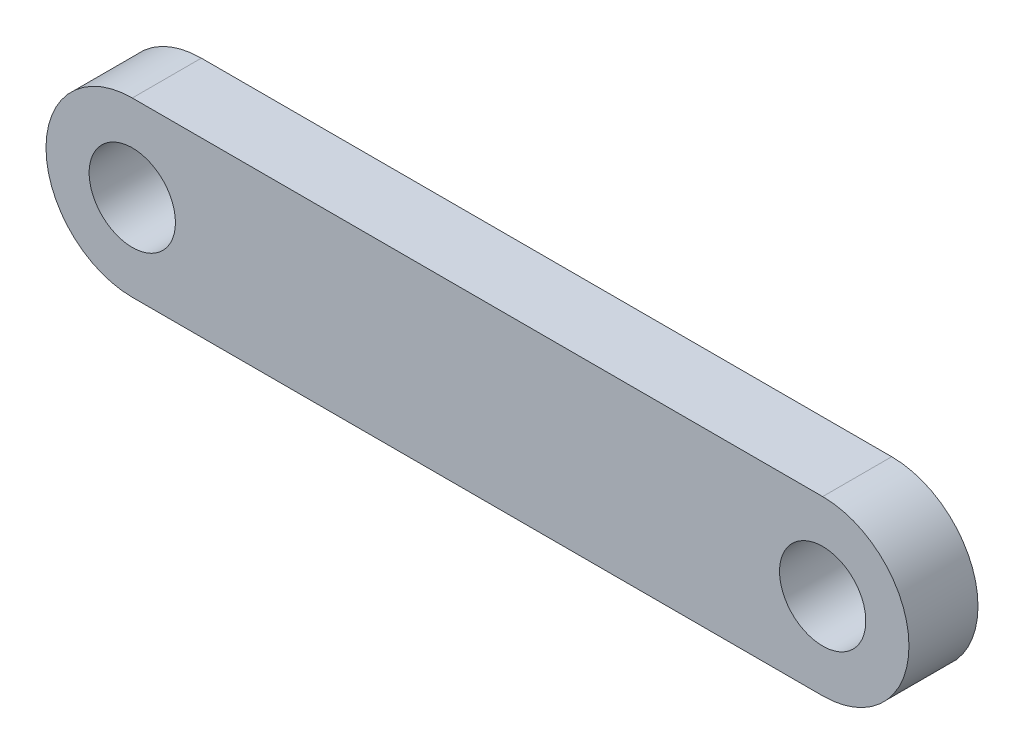
ISO-10303-21;
HEADER;
FILE_DESCRIPTION(('STEP AP214'),'2;1');
FILE_NAME('part.step','',(''),(''),'','','');
FILE_SCHEMA(('AUTOMOTIVE_DESIGN { 1 0 10303 214 1 1 1 1 }'));
ENDSEC;
DATA;
#1=APPLICATION_CONTEXT('core data for automotive mechanical design processes');
#2=APPLICATION_PROTOCOL_DEFINITION('international standard','automotive_design',2000,#1);
#3=PRODUCT_CONTEXT('',#1,'mechanical');
#4=PRODUCT('Part','Part','',(#3));
#5=PRODUCT_RELATED_PRODUCT_CATEGORY('part','',(#4));
#6=PRODUCT_DEFINITION_FORMATION('','',#4);
#7=PRODUCT_DEFINITION_CONTEXT('part definition',#1,'design');
#8=PRODUCT_DEFINITION('design','',#6,#7);
#9=PRODUCT_DEFINITION_SHAPE('','',#8);
#10=(LENGTH_UNIT() NAMED_UNIT(*) SI_UNIT(.MILLI.,.METRE.));
#11=(NAMED_UNIT(*) PLANE_ANGLE_UNIT() SI_UNIT($,.RADIAN.));
#12=(NAMED_UNIT(*) SI_UNIT($,.STERADIAN.) SOLID_ANGLE_UNIT());
#13=UNCERTAINTY_MEASURE_WITH_UNIT(LENGTH_MEASURE(1.E-05),#10,'distance_accuracy_value','');
#14=(GEOMETRIC_REPRESENTATION_CONTEXT(3) GLOBAL_UNCERTAINTY_ASSIGNED_CONTEXT((#13)) GLOBAL_UNIT_ASSIGNED_CONTEXT((#10,
#11,#12)) REPRESENTATION_CONTEXT('',''));
#15=CARTESIAN_POINT('',(0.,0.,0.));
#16=DIRECTION('',(0.,0.,1.));
#17=DIRECTION('',(1.,0.,0.));
#18=AXIS2_PLACEMENT_3D('',#15,#16,#17);
#19=CARTESIAN_POINT('',(-25.4,0.,5.08));
#20=DIRECTION('',(0.,0.,1.));
#21=DIRECTION('',(1.,0.,0.));
#22=AXIS2_PLACEMENT_3D('',#19,#20,#21);
#23=PLANE('',#22);
#24=CARTESIAN_POINT('',(-25.4,0.,5.08));
#25=DIRECTION('',(0.,0.,1.));
#26=DIRECTION('',(1.,0.,0.));
#27=AXIS2_PLACEMENT_3D('',#24,#25,#26);
#28=CIRCLE('',#27,3.175);
#29=CARTESIAN_POINT('',(-22.225,0.,5.08));
#30=VERTEX_POINT('',#29);
#31=EDGE_CURVE('E100',#30,#30,#28,.T.);
#32=ORIENTED_EDGE('',*,*,#31,.F.);
#33=EDGE_LOOP('',(#32));
#34=FACE_BOUND('',#33,.T.);
#35=CARTESIAN_POINT('',(-25.4,0.,5.08));
#36=DIRECTION('',(0.,0.,1.));
#37=DIRECTION('',(1.,0.,0.));
#38=AXIS2_PLACEMENT_3D('',#35,#36,#37);
#39=CIRCLE('',#38,6.35);
#40=CARTESIAN_POINT('',(-25.4,6.35,5.08));
#41=VERTEX_POINT('',#40);
#42=CARTESIAN_POINT('',(-25.4,-6.35,5.08));
#43=VERTEX_POINT('',#42);
#44=EDGE_CURVE('E85',#41,#43,#39,.T.);
#45=ORIENTED_EDGE('',*,*,#44,.T.);
#46=DIRECTION('',(1.,0.,0.));
#47=VECTOR('',#46,1.);
#48=CARTESIAN_POINT('',(-25.4,-6.35,5.08));
#49=LINE('',#48,#47);
#50=CARTESIAN_POINT('',(25.4,-6.35,5.08));
#51=VERTEX_POINT('',#50);
#52=EDGE_CURVE('E80',#43,#51,#49,.T.);
#53=ORIENTED_EDGE('',*,*,#52,.T.);
#54=CARTESIAN_POINT('',(25.4,0.,5.08));
#55=DIRECTION('',(0.,0.,1.));
#56=DIRECTION('',(1.,0.,0.));
#57=AXIS2_PLACEMENT_3D('',#54,#55,#56);
#58=CIRCLE('',#57,6.35);
#59=CARTESIAN_POINT('',(25.4,6.35,5.08));
#60=VERTEX_POINT('',#59);
#61=EDGE_CURVE('E83',#51,#60,#58,.T.);
#62=ORIENTED_EDGE('',*,*,#61,.T.);
#63=DIRECTION('',(-1.,0.,0.));
#64=VECTOR('',#63,1.);
#65=CARTESIAN_POINT('',(-25.4,6.35,5.08));
#66=LINE('',#65,#64);
#67=EDGE_CURVE('E50',#60,#41,#66,.T.);
#68=ORIENTED_EDGE('',*,*,#67,.T.);
#69=EDGE_LOOP('',(#45,#53,#62,#68));
#70=FACE_BOUND('',#69,.T.);
#71=CARTESIAN_POINT('',(25.4,0.,5.08));
#72=DIRECTION('',(0.,0.,1.));
#73=DIRECTION('',(-1.,0.,0.));
#74=AXIS2_PLACEMENT_3D('',#71,#72,#73);
#75=CIRCLE('',#74,3.175);
#76=CARTESIAN_POINT('',(22.225,0.,5.08));
#77=VERTEX_POINT('',#76);
#78=EDGE_CURVE('E115',#77,#77,#75,.T.);
#79=ORIENTED_EDGE('',*,*,#78,.F.);
#80=EDGE_LOOP('',(#79));
#81=FACE_BOUND('',#80,.T.);
#82=ADVANCED_FACE('F33',(#34,#70,#81),#23,.T.);
#83=CARTESIAN_POINT('',(-25.4,0.,0.));
#84=DIRECTION('',(0.,0.,1.));
#85=DIRECTION('',(1.,0.,0.));
#86=AXIS2_PLACEMENT_3D('',#83,#84,#85);
#87=PLANE('',#86);
#88=CARTESIAN_POINT('',(-25.4,0.,0.));
#89=DIRECTION('',(0.,0.,1.));
#90=DIRECTION('',(1.,0.,0.));
#91=AXIS2_PLACEMENT_3D('',#88,#89,#90);
#92=CIRCLE('',#91,6.35);
#93=CARTESIAN_POINT('',(-25.4,6.35,0.));
#94=VERTEX_POINT('',#93);
#95=CARTESIAN_POINT('',(-25.4,-6.35,0.));
#96=VERTEX_POINT('',#95);
#97=EDGE_CURVE('E97',#94,#96,#92,.T.);
#98=ORIENTED_EDGE('',*,*,#97,.F.);
#99=DIRECTION('',(-1.,0.,0.));
#100=VECTOR('',#99,1.);
#101=CARTESIAN_POINT('',(-25.4,6.35,0.));
#102=LINE('',#101,#100);
#103=CARTESIAN_POINT('',(25.4,6.35,0.));
#104=VERTEX_POINT('',#103);
#105=EDGE_CURVE('E73',#104,#94,#102,.T.);
#106=ORIENTED_EDGE('',*,*,#105,.F.);
#107=CARTESIAN_POINT('',(25.4,0.,0.));
#108=DIRECTION('',(0.,0.,1.));
#109=DIRECTION('',(1.,0.,0.));
#110=AXIS2_PLACEMENT_3D('',#107,#108,#109);
#111=CIRCLE('',#110,6.35);
#112=CARTESIAN_POINT('',(25.4,-6.35,0.));
#113=VERTEX_POINT('',#112);
#114=EDGE_CURVE('E67',#113,#104,#111,.T.);
#115=ORIENTED_EDGE('',*,*,#114,.F.);
#116=DIRECTION('',(1.,0.,0.));
#117=VECTOR('',#116,1.);
#118=CARTESIAN_POINT('',(-25.4,-6.35,0.));
#119=LINE('',#118,#117);
#120=EDGE_CURVE('E89',#96,#113,#119,.T.);
#121=ORIENTED_EDGE('',*,*,#120,.F.);
#122=EDGE_LOOP('',(#98,#106,#115,#121));
#123=FACE_BOUND('',#122,.T.);
#124=CARTESIAN_POINT('',(-25.4,0.,0.));
#125=DIRECTION('',(0.,0.,1.));
#126=DIRECTION('',(1.,0.,0.));
#127=AXIS2_PLACEMENT_3D('',#124,#125,#126);
#128=CIRCLE('',#127,3.175);
#129=CARTESIAN_POINT('',(-22.225,0.,0.));
#130=VERTEX_POINT('',#129);
#131=EDGE_CURVE('E112',#130,#130,#128,.T.);
#132=ORIENTED_EDGE('',*,*,#131,.T.);
#133=EDGE_LOOP('',(#132));
#134=FACE_BOUND('',#133,.T.);
#135=CARTESIAN_POINT('',(25.4,0.,0.));
#136=DIRECTION('',(0.,0.,1.));
#137=DIRECTION('',(-1.,0.,0.));
#138=AXIS2_PLACEMENT_3D('',#135,#136,#137);
#139=CIRCLE('',#138,3.175);
#140=CARTESIAN_POINT('',(22.225,0.,0.));
#141=VERTEX_POINT('',#140);
#142=EDGE_CURVE('E118',#141,#141,#139,.T.);
#143=ORIENTED_EDGE('',*,*,#142,.T.);
#144=EDGE_LOOP('',(#143));
#145=FACE_BOUND('',#144,.T.);
#146=ADVANCED_FACE('F108',(#123,#134,#145),#87,.F.);
#147=CARTESIAN_POINT('',(-25.4,0.,5.08));
#148=DIRECTION('',(0.,0.,-1.));
#149=DIRECTION('',(-1.,0.,0.));
#150=AXIS2_PLACEMENT_3D('',#147,#148,#149);
#151=CYLINDRICAL_SURFACE('',#150,6.35);
#152=ORIENTED_EDGE('',*,*,#97,.T.);
#153=DIRECTION('',(0.,0.,-1.));
#154=VECTOR('',#153,1.);
#155=CARTESIAN_POINT('',(-25.4,-6.35,5.08));
#156=LINE('',#155,#154);
#157=EDGE_CURVE('E11',#43,#96,#156,.T.);
#158=ORIENTED_EDGE('',*,*,#157,.F.);
#159=ORIENTED_EDGE('',*,*,#44,.F.);
#160=DIRECTION('',(0.,0.,-1.));
#161=VECTOR('',#160,1.);
#162=CARTESIAN_POINT('',(-25.4,6.35,5.08));
#163=LINE('',#162,#161);
#164=EDGE_CURVE('E93',#41,#94,#163,.T.);
#165=ORIENTED_EDGE('',*,*,#164,.T.);
#166=EDGE_LOOP('',(#152,#158,#159,#165));
#167=FACE_BOUND('',#166,.T.);
#168=ADVANCED_FACE('F35',(#167),#151,.T.);
#169=CARTESIAN_POINT('',(-25.4,-6.35,5.08));
#170=DIRECTION('',(0.,1.,0.));
#171=DIRECTION('',(0.,0.,1.));
#172=AXIS2_PLACEMENT_3D('',#169,#170,#171);
#173=PLANE('',#172);
#174=ORIENTED_EDGE('',*,*,#120,.T.);
#175=DIRECTION('',(0.,0.,-1.));
#176=VECTOR('',#175,1.);
#177=CARTESIAN_POINT('',(25.4,-6.35,5.08));
#178=LINE('',#177,#176);
#179=EDGE_CURVE('E42',#51,#113,#178,.T.);
#180=ORIENTED_EDGE('',*,*,#179,.F.);
#181=ORIENTED_EDGE('',*,*,#52,.F.);
#182=ORIENTED_EDGE('',*,*,#157,.T.);
#183=EDGE_LOOP('',(#174,#180,#181,#182));
#184=FACE_BOUND('',#183,.T.);
#185=ADVANCED_FACE('F88',(#184),#173,.F.);
#186=CARTESIAN_POINT('',(25.4,0.,5.08));
#187=DIRECTION('',(0.,0.,-1.));
#188=DIRECTION('',(-1.,0.,0.));
#189=AXIS2_PLACEMENT_3D('',#186,#187,#188);
#190=CYLINDRICAL_SURFACE('',#189,6.35);
#191=ORIENTED_EDGE('',*,*,#114,.T.);
#192=DIRECTION('',(0.,0.,-1.));
#193=VECTOR('',#192,1.);
#194=CARTESIAN_POINT('',(25.4,6.35,5.08));
#195=LINE('',#194,#193);
#196=EDGE_CURVE('E90',#60,#104,#195,.T.);
#197=ORIENTED_EDGE('',*,*,#196,.F.);
#198=ORIENTED_EDGE('',*,*,#61,.F.);
#199=ORIENTED_EDGE('',*,*,#179,.T.);
#200=EDGE_LOOP('',(#191,#197,#198,#199));
#201=FACE_BOUND('',#200,.T.);
#202=ADVANCED_FACE('F91',(#201),#190,.T.);
#203=CARTESIAN_POINT('',(-25.4,6.35,5.08));
#204=DIRECTION('',(0.,-1.,0.));
#205=DIRECTION('',(0.,0.,-1.));
#206=AXIS2_PLACEMENT_3D('',#203,#204,#205);
#207=PLANE('',#206);
#208=ORIENTED_EDGE('',*,*,#105,.T.);
#209=ORIENTED_EDGE('',*,*,#164,.F.);
#210=ORIENTED_EDGE('',*,*,#67,.F.);
#211=ORIENTED_EDGE('',*,*,#196,.T.);
#212=EDGE_LOOP('',(#208,#209,#210,#211));
#213=FACE_BOUND('',#212,.T.);
#214=ADVANCED_FACE('F105',(#213),#207,.F.);
#215=CARTESIAN_POINT('',(-25.4,0.,5.08));
#216=DIRECTION('',(0.,0.,-1.));
#217=DIRECTION('',(-1.,0.,0.));
#218=AXIS2_PLACEMENT_3D('',#215,#216,#217);
#219=CYLINDRICAL_SURFACE('',#218,3.175);
#220=ORIENTED_EDGE('',*,*,#31,.T.);
#221=EDGE_LOOP('',(#220));
#222=FACE_BOUND('',#221,.T.);
#223=ORIENTED_EDGE('',*,*,#131,.F.);
#224=EDGE_LOOP('',(#223));
#225=FACE_BOUND('',#224,.T.);
#226=ADVANCED_FACE('F135',(#222,#225),#219,.F.);
#227=CARTESIAN_POINT('',(25.4,0.,5.08));
#228=DIRECTION('',(0.,0.,-1.));
#229=DIRECTION('',(-1.,0.,0.));
#230=AXIS2_PLACEMENT_3D('',#227,#228,#229);
#231=CYLINDRICAL_SURFACE('',#230,3.175);
#232=ORIENTED_EDGE('',*,*,#78,.T.);
#233=EDGE_LOOP('',(#232));
#234=FACE_BOUND('',#233,.T.);
#235=ORIENTED_EDGE('',*,*,#142,.F.);
#236=EDGE_LOOP('',(#235));
#237=FACE_BOUND('',#236,.T.);
#238=ADVANCED_FACE('F124',(#234,#237),#231,.F.);
#239=CLOSED_SHELL('',(#82,#146,#168,#185,#202,#214,#226,#238));
#240=MANIFOLD_SOLID_BREP('B2',#239);
#241=ADVANCED_BREP_SHAPE_REPRESENTATION('',(#18,#240),#14);
#242=SHAPE_DEFINITION_REPRESENTATION(#9,#241);
ENDSEC;
END-ISO-10303-21;
